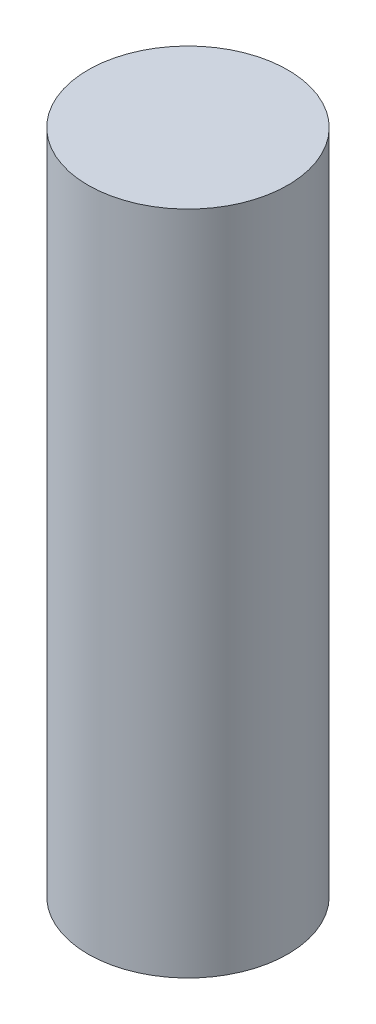
ISO-10303-21;
HEADER;
FILE_DESCRIPTION(('STEP AP214'),'2;1');
FILE_NAME('part.step','',(''),(''),'','','');
FILE_SCHEMA(('AUTOMOTIVE_DESIGN { 1 0 10303 214 1 1 1 1 }'));
ENDSEC;
DATA;
#1=APPLICATION_CONTEXT('core data for automotive mechanical design processes');
#2=APPLICATION_PROTOCOL_DEFINITION('international standard','automotive_design',2000,#1);
#3=PRODUCT_CONTEXT('',#1,'mechanical');
#4=PRODUCT('Part','Part','',(#3));
#5=PRODUCT_RELATED_PRODUCT_CATEGORY('part','',(#4));
#6=PRODUCT_DEFINITION_FORMATION('','',#4);
#7=PRODUCT_DEFINITION_CONTEXT('part definition',#1,'design');
#8=PRODUCT_DEFINITION('design','',#6,#7);
#9=PRODUCT_DEFINITION_SHAPE('','',#8);
#10=(LENGTH_UNIT() NAMED_UNIT(*) SI_UNIT(.MILLI.,.METRE.));
#11=(NAMED_UNIT(*) PLANE_ANGLE_UNIT() SI_UNIT($,.RADIAN.));
#12=(NAMED_UNIT(*) SI_UNIT($,.STERADIAN.) SOLID_ANGLE_UNIT());
#13=UNCERTAINTY_MEASURE_WITH_UNIT(LENGTH_MEASURE(1.E-05),#10,'distance_accuracy_value','');
#14=(GEOMETRIC_REPRESENTATION_CONTEXT(3) GLOBAL_UNCERTAINTY_ASSIGNED_CONTEXT((#13)) GLOBAL_UNIT_ASSIGNED_CONTEXT((#10,
#11,#12)) REPRESENTATION_CONTEXT('',''));
#15=CARTESIAN_POINT('',(0.,0.,0.));
#16=DIRECTION('',(0.,0.,1.));
#17=DIRECTION('',(1.,0.,0.));
#18=AXIS2_PLACEMENT_3D('',#15,#16,#17);
#19=CARTESIAN_POINT('',(0.,20.,0.));
#20=DIRECTION('',(0.,-1.,0.));
#21=DIRECTION('',(0.,0.,-1.));
#22=AXIS2_PLACEMENT_3D('',#19,#20,#21);
#23=CYLINDRICAL_SURFACE('',#22,3.);
#24=CARTESIAN_POINT('',(0.,20.,0.));
#25=DIRECTION('',(0.,1.,0.));
#26=DIRECTION('',(0.,0.,1.));
#27=AXIS2_PLACEMENT_3D('',#24,#25,#26);
#28=CIRCLE('',#27,3.);
#29=CARTESIAN_POINT('',(0.,20.,3.));
#30=VERTEX_POINT('',#29);
#31=EDGE_CURVE('E10',#30,#30,#28,.T.);
#32=ORIENTED_EDGE('',*,*,#31,.F.);
#33=EDGE_LOOP('',(#32));
#34=FACE_BOUND('',#33,.T.);
#35=CARTESIAN_POINT('',(0.,0.,0.));
#36=DIRECTION('',(0.,1.,0.));
#37=DIRECTION('',(0.,0.,1.));
#38=AXIS2_PLACEMENT_3D('',#35,#36,#37);
#39=CIRCLE('',#38,3.);
#40=CARTESIAN_POINT('',(0.,0.,3.));
#41=VERTEX_POINT('',#40);
#42=EDGE_CURVE('E42',#41,#41,#39,.T.);
#43=ORIENTED_EDGE('',*,*,#42,.T.);
#44=EDGE_LOOP('',(#43));
#45=FACE_BOUND('',#44,.T.);
#46=ADVANCED_FACE('F39',(#34,#45),#23,.T.);
#47=CARTESIAN_POINT('',(0.,20.,0.));
#48=DIRECTION('',(0.,1.,0.));
#49=DIRECTION('',(0.,0.,1.));
#50=AXIS2_PLACEMENT_3D('',#47,#48,#49);
#51=PLANE('',#50);
#52=ORIENTED_EDGE('',*,*,#31,.T.);
#53=EDGE_LOOP('',(#52));
#54=FACE_BOUND('',#53,.T.);
#55=ADVANCED_FACE('F54',(#54),#51,.T.);
#56=CARTESIAN_POINT('',(0.,0.,0.));
#57=DIRECTION('',(0.,1.,0.));
#58=DIRECTION('',(0.,0.,1.));
#59=AXIS2_PLACEMENT_3D('',#56,#57,#58);
#60=PLANE('',#59);
#61=ORIENTED_EDGE('',*,*,#42,.F.);
#62=EDGE_LOOP('',(#61));
#63=FACE_BOUND('',#62,.T.);
#64=ADVANCED_FACE('F52',(#63),#60,.F.);
#65=CLOSED_SHELL('',(#46,#55,#64));
#66=MANIFOLD_SOLID_BREP('B2',#65);
#67=ADVANCED_BREP_SHAPE_REPRESENTATION('',(#18,#66),#14);
#68=SHAPE_DEFINITION_REPRESENTATION(#9,#67);
ENDSEC;
END-ISO-10303-21;
